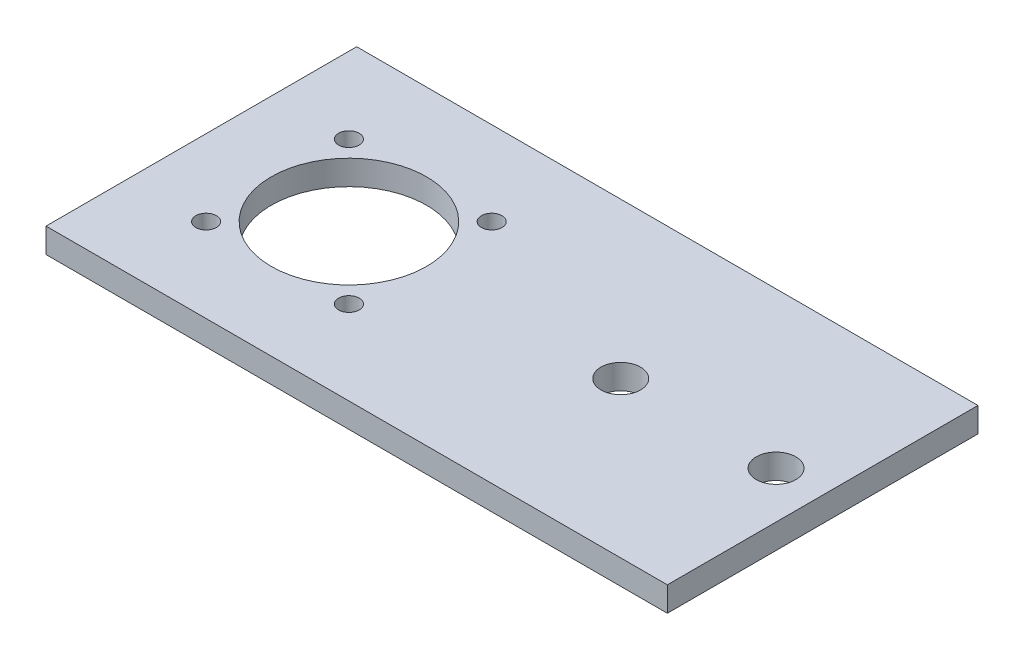
ISO-10303-21;
HEADER;
FILE_DESCRIPTION(('STEP AP214'),'2;1');
FILE_NAME('part.step','',(''),(''),'','','');
FILE_SCHEMA(('AUTOMOTIVE_DESIGN { 1 0 10303 214 1 1 1 1 }'));
ENDSEC;
DATA;
#1=APPLICATION_CONTEXT('core data for automotive mechanical design processes');
#2=APPLICATION_PROTOCOL_DEFINITION('international standard','automotive_design',2000,#1);
#3=PRODUCT_CONTEXT('',#1,'mechanical');
#4=PRODUCT('Part','Part','',(#3));
#5=PRODUCT_RELATED_PRODUCT_CATEGORY('part','',(#4));
#6=PRODUCT_DEFINITION_FORMATION('','',#4);
#7=PRODUCT_DEFINITION_CONTEXT('part definition',#1,'design');
#8=PRODUCT_DEFINITION('design','',#6,#7);
#9=PRODUCT_DEFINITION_SHAPE('','',#8);
#10=(LENGTH_UNIT() NAMED_UNIT(*) SI_UNIT(.MILLI.,.METRE.));
#11=(NAMED_UNIT(*) PLANE_ANGLE_UNIT() SI_UNIT($,.RADIAN.));
#12=(NAMED_UNIT(*) SI_UNIT($,.STERADIAN.) SOLID_ANGLE_UNIT());
#13=UNCERTAINTY_MEASURE_WITH_UNIT(LENGTH_MEASURE(1.E-05),#10,'distance_accuracy_value','');
#14=(GEOMETRIC_REPRESENTATION_CONTEXT(3) GLOBAL_UNCERTAINTY_ASSIGNED_CONTEXT((#13)) GLOBAL_UNIT_ASSIGNED_CONTEXT((#10,
#11,#12)) REPRESENTATION_CONTEXT('',''));
#15=CARTESIAN_POINT('',(0.,0.,0.));
#16=DIRECTION('',(0.,0.,1.));
#17=DIRECTION('',(1.,0.,0.));
#18=AXIS2_PLACEMENT_3D('',#15,#16,#17);
#19=CARTESIAN_POINT('',(0.,3.175,0.));
#20=DIRECTION('',(0.,-1.,0.));
#21=DIRECTION('',(0.,0.,-1.));
#22=AXIS2_PLACEMENT_3D('',#19,#20,#21);
#23=PLANE('',#22);
#24=DIRECTION('',(0.,0.,1.));
#25=VECTOR('',#24,1.);
#26=CARTESIAN_POINT('',(0.,3.175,0.));
#27=LINE('',#26,#25);
#28=CARTESIAN_POINT('',(0.,3.175,-40.));
#29=VERTEX_POINT('',#28);
#30=CARTESIAN_POINT('',(0.,3.175,0.));
#31=VERTEX_POINT('',#30);
#32=EDGE_CURVE('E99',#29,#31,#27,.T.);
#33=ORIENTED_EDGE('',*,*,#32,.T.);
#34=DIRECTION('',(1.,0.,0.));
#35=VECTOR('',#34,1.);
#36=CARTESIAN_POINT('',(0.,3.175,0.));
#37=LINE('',#36,#35);
#38=CARTESIAN_POINT('',(80.,3.175,0.));
#39=VERTEX_POINT('',#38);
#40=EDGE_CURVE('E94',#31,#39,#37,.T.);
#41=ORIENTED_EDGE('',*,*,#40,.T.);
#42=DIRECTION('',(0.,0.,-1.));
#43=VECTOR('',#42,1.);
#44=CARTESIAN_POINT('',(80.,3.175,0.));
#45=LINE('',#44,#43);
#46=CARTESIAN_POINT('',(80.,3.175,-40.));
#47=VERTEX_POINT('',#46);
#48=EDGE_CURVE('E97',#39,#47,#45,.T.);
#49=ORIENTED_EDGE('',*,*,#48,.T.);
#50=DIRECTION('',(-1.,0.,0.));
#51=VECTOR('',#50,1.);
#52=CARTESIAN_POINT('',(0.,3.175,-40.));
#53=LINE('',#52,#51);
#54=EDGE_CURVE('E64',#47,#29,#53,.T.);
#55=ORIENTED_EDGE('',*,*,#54,.T.);
#56=EDGE_LOOP('',(#33,#41,#49,#55));
#57=FACE_BOUND('',#56,.T.);
#58=CARTESIAN_POINT('',(54.,3.175,-20.));
#59=DIRECTION('',(0.,1.,0.));
#60=DIRECTION('',(0.,0.,1.));
#61=AXIS2_PLACEMENT_3D('',#58,#59,#60);
#62=CIRCLE('',#61,2.55);
#63=CARTESIAN_POINT('',(54.,3.175,-17.45));
#64=VERTEX_POINT('',#63);
#65=EDGE_CURVE('E114',#64,#64,#62,.T.);
#66=ORIENTED_EDGE('',*,*,#65,.F.);
#67=EDGE_LOOP('',(#66));
#68=FACE_BOUND('',#67,.T.);
#69=CARTESIAN_POINT('',(74.,3.175,-20.));
#70=DIRECTION('',(0.,1.,0.));
#71=DIRECTION('',(0.,0.,1.));
#72=AXIS2_PLACEMENT_3D('',#69,#70,#71);
#73=CIRCLE('',#72,2.54999999999999);
#74=CARTESIAN_POINT('',(74.,3.175,-17.45));
#75=VERTEX_POINT('',#74);
#76=EDGE_CURVE('E129',#75,#75,#73,.T.);
#77=ORIENTED_EDGE('',*,*,#76,.F.);
#78=EDGE_LOOP('',(#77));
#79=FACE_BOUND('',#78,.T.);
#80=CARTESIAN_POINT('',(19.,3.175,-20.));
#81=DIRECTION('',(0.,1.,0.));
#82=DIRECTION('',(0.,0.,1.));
#83=AXIS2_PLACEMENT_3D('',#80,#81,#82);
#84=CIRCLE('',#83,10.);
#85=CARTESIAN_POINT('',(19.,3.175,-10.));
#86=VERTEX_POINT('',#85);
#87=EDGE_CURVE('E135',#86,#86,#84,.T.);
#88=ORIENTED_EDGE('',*,*,#87,.F.);
#89=EDGE_LOOP('',(#88));
#90=FACE_BOUND('',#89,.T.);
#91=CARTESIAN_POINT('',(28.1923881554252,3.175,-10.8076118445749));
#92=DIRECTION('',(0.,1.,0.));
#93=DIRECTION('',(0.,0.,1.));
#94=AXIS2_PLACEMENT_3D('',#91,#92,#93);
#95=CIRCLE('',#94,1.325);
#96=CARTESIAN_POINT('',(28.1923881554252,3.175,-9.48261184457495));
#97=VERTEX_POINT('',#96);
#98=EDGE_CURVE('E141',#97,#97,#95,.T.);
#99=ORIENTED_EDGE('',*,*,#98,.F.);
#100=EDGE_LOOP('',(#99));
#101=FACE_BOUND('',#100,.T.);
#102=CARTESIAN_POINT('',(9.80761184457494,3.175,-10.8076118445748));
#103=DIRECTION('',(0.,1.,0.));
#104=DIRECTION('',(0.,0.,1.));
#105=AXIS2_PLACEMENT_3D('',#102,#103,#104);
#106=CIRCLE('',#105,1.325);
#107=CARTESIAN_POINT('',(9.80761184457494,3.175,-9.48261184457483));
#108=VERTEX_POINT('',#107);
#109=EDGE_CURVE('E147',#108,#108,#106,.T.);
#110=ORIENTED_EDGE('',*,*,#109,.F.);
#111=EDGE_LOOP('',(#110));
#112=FACE_BOUND('',#111,.T.);
#113=CARTESIAN_POINT('',(9.80761184457482,3.175,-29.1923881554251));
#114=DIRECTION('',(0.,1.,0.));
#115=DIRECTION('',(0.,0.,1.));
#116=AXIS2_PLACEMENT_3D('',#113,#114,#115);
#117=CIRCLE('',#116,1.325);
#118=CARTESIAN_POINT('',(9.80761184457482,3.175,-27.8673881554251));
#119=VERTEX_POINT('',#118);
#120=EDGE_CURVE('E153',#119,#119,#117,.T.);
#121=ORIENTED_EDGE('',*,*,#120,.F.);
#122=EDGE_LOOP('',(#121));
#123=FACE_BOUND('',#122,.T.);
#124=CARTESIAN_POINT('',(28.1923881554251,3.175,-29.1923881554252));
#125=DIRECTION('',(0.,1.,0.));
#126=DIRECTION('',(0.,0.,1.));
#127=AXIS2_PLACEMENT_3D('',#124,#125,#126);
#128=CIRCLE('',#127,1.325);
#129=CARTESIAN_POINT('',(28.1923881554251,3.175,-27.8673881554252));
#130=VERTEX_POINT('',#129);
#131=EDGE_CURVE('E159',#130,#130,#128,.T.);
#132=ORIENTED_EDGE('',*,*,#131,.F.);
#133=EDGE_LOOP('',(#132));
#134=FACE_BOUND('',#133,.T.);
#135=ADVANCED_FACE('F47',(#57,#68,#79,#90,#101,#112,#123,#134),#23,.F.);
#136=CARTESIAN_POINT('',(0.,0.,0.));
#137=DIRECTION('',(0.,-1.,0.));
#138=DIRECTION('',(0.,0.,-1.));
#139=AXIS2_PLACEMENT_3D('',#136,#137,#138);
#140=PLANE('',#139);
#141=CARTESIAN_POINT('',(9.80761184457482,0.,-29.1923881554251));
#142=DIRECTION('',(0.,1.,0.));
#143=DIRECTION('',(0.,0.,1.));
#144=AXIS2_PLACEMENT_3D('',#141,#142,#143);
#145=CIRCLE('',#144,1.325);
#146=CARTESIAN_POINT('',(9.80761184457482,0.,-27.8673881554251));
#147=VERTEX_POINT('',#146);
#148=EDGE_CURVE('E156',#147,#147,#145,.T.);
#149=ORIENTED_EDGE('',*,*,#148,.T.);
#150=EDGE_LOOP('',(#149));
#151=FACE_BOUND('',#150,.T.);
#152=CARTESIAN_POINT('',(28.1923881554252,0.,-10.8076118445749));
#153=DIRECTION('',(0.,1.,0.));
#154=DIRECTION('',(0.,0.,1.));
#155=AXIS2_PLACEMENT_3D('',#152,#153,#154);
#156=CIRCLE('',#155,1.325);
#157=CARTESIAN_POINT('',(28.1923881554252,0.,-9.48261184457495));
#158=VERTEX_POINT('',#157);
#159=EDGE_CURVE('E144',#158,#158,#156,.T.);
#160=ORIENTED_EDGE('',*,*,#159,.T.);
#161=EDGE_LOOP('',(#160));
#162=FACE_BOUND('',#161,.T.);
#163=CARTESIAN_POINT('',(74.,0.,-20.));
#164=DIRECTION('',(0.,1.,0.));
#165=DIRECTION('',(0.,0.,1.));
#166=AXIS2_PLACEMENT_3D('',#163,#164,#165);
#167=CIRCLE('',#166,2.54999999999999);
#168=CARTESIAN_POINT('',(74.,0.,-17.45));
#169=VERTEX_POINT('',#168);
#170=EDGE_CURVE('E132',#169,#169,#167,.T.);
#171=ORIENTED_EDGE('',*,*,#170,.T.);
#172=EDGE_LOOP('',(#171));
#173=FACE_BOUND('',#172,.T.);
#174=DIRECTION('',(0.,0.,1.));
#175=VECTOR('',#174,1.);
#176=CARTESIAN_POINT('',(0.,0.,0.));
#177=LINE('',#176,#175);
#178=CARTESIAN_POINT('',(0.,0.,-40.));
#179=VERTEX_POINT('',#178);
#180=CARTESIAN_POINT('',(0.,0.,0.));
#181=VERTEX_POINT('',#180);
#182=EDGE_CURVE('E111',#179,#181,#177,.T.);
#183=ORIENTED_EDGE('',*,*,#182,.F.);
#184=DIRECTION('',(-1.,0.,0.));
#185=VECTOR('',#184,1.);
#186=CARTESIAN_POINT('',(0.,0.,-40.));
#187=LINE('',#186,#185);
#188=CARTESIAN_POINT('',(80.,0.,-40.));
#189=VERTEX_POINT('',#188);
#190=EDGE_CURVE('E87',#189,#179,#187,.T.);
#191=ORIENTED_EDGE('',*,*,#190,.F.);
#192=DIRECTION('',(0.,0.,-1.));
#193=VECTOR('',#192,1.);
#194=CARTESIAN_POINT('',(80.,0.,0.));
#195=LINE('',#194,#193);
#196=CARTESIAN_POINT('',(80.,0.,0.));
#197=VERTEX_POINT('',#196);
#198=EDGE_CURVE('E81',#197,#189,#195,.T.);
#199=ORIENTED_EDGE('',*,*,#198,.F.);
#200=DIRECTION('',(1.,0.,0.));
#201=VECTOR('',#200,1.);
#202=CARTESIAN_POINT('',(0.,0.,0.));
#203=LINE('',#202,#201);
#204=EDGE_CURVE('E103',#181,#197,#203,.T.);
#205=ORIENTED_EDGE('',*,*,#204,.F.);
#206=EDGE_LOOP('',(#183,#191,#199,#205));
#207=FACE_BOUND('',#206,.T.);
#208=CARTESIAN_POINT('',(54.,0.,-20.));
#209=DIRECTION('',(0.,1.,0.));
#210=DIRECTION('',(0.,0.,1.));
#211=AXIS2_PLACEMENT_3D('',#208,#209,#210);
#212=CIRCLE('',#211,2.55);
#213=CARTESIAN_POINT('',(54.,0.,-17.45));
#214=VERTEX_POINT('',#213);
#215=EDGE_CURVE('E126',#214,#214,#212,.T.);
#216=ORIENTED_EDGE('',*,*,#215,.T.);
#217=EDGE_LOOP('',(#216));
#218=FACE_BOUND('',#217,.T.);
#219=CARTESIAN_POINT('',(19.,0.,-20.));
#220=DIRECTION('',(0.,1.,0.));
#221=DIRECTION('',(0.,0.,1.));
#222=AXIS2_PLACEMENT_3D('',#219,#220,#221);
#223=CIRCLE('',#222,10.);
#224=CARTESIAN_POINT('',(19.,0.,-10.));
#225=VERTEX_POINT('',#224);
#226=EDGE_CURVE('E138',#225,#225,#223,.T.);
#227=ORIENTED_EDGE('',*,*,#226,.T.);
#228=EDGE_LOOP('',(#227));
#229=FACE_BOUND('',#228,.T.);
#230=CARTESIAN_POINT('',(9.80761184457494,0.,-10.8076118445748));
#231=DIRECTION('',(0.,1.,0.));
#232=DIRECTION('',(0.,0.,1.));
#233=AXIS2_PLACEMENT_3D('',#230,#231,#232);
#234=CIRCLE('',#233,1.325);
#235=CARTESIAN_POINT('',(9.80761184457494,0.,-9.48261184457483));
#236=VERTEX_POINT('',#235);
#237=EDGE_CURVE('E150',#236,#236,#234,.T.);
#238=ORIENTED_EDGE('',*,*,#237,.T.);
#239=EDGE_LOOP('',(#238));
#240=FACE_BOUND('',#239,.T.);
#241=CARTESIAN_POINT('',(28.1923881554251,0.,-29.1923881554252));
#242=DIRECTION('',(0.,1.,0.));
#243=DIRECTION('',(0.,0.,1.));
#244=AXIS2_PLACEMENT_3D('',#241,#242,#243);
#245=CIRCLE('',#244,1.325);
#246=CARTESIAN_POINT('',(28.1923881554251,0.,-27.8673881554252));
#247=VERTEX_POINT('',#246);
#248=EDGE_CURVE('E162',#247,#247,#245,.T.);
#249=ORIENTED_EDGE('',*,*,#248,.T.);
#250=EDGE_LOOP('',(#249));
#251=FACE_BOUND('',#250,.T.);
#252=ADVANCED_FACE('F122',(#151,#162,#173,#207,#218,#229,#240,#251),#140,.T.);
#253=CARTESIAN_POINT('',(0.,3.175,0.));
#254=DIRECTION('',(1.,0.,0.));
#255=DIRECTION('',(0.,0.,-1.));
#256=AXIS2_PLACEMENT_3D('',#253,#254,#255);
#257=PLANE('',#256);
#258=ORIENTED_EDGE('',*,*,#182,.T.);
#259=DIRECTION('',(0.,-1.,0.));
#260=VECTOR('',#259,1.);
#261=CARTESIAN_POINT('',(0.,3.175,0.));
#262=LINE('',#261,#260);
#263=EDGE_CURVE('E13',#31,#181,#262,.T.);
#264=ORIENTED_EDGE('',*,*,#263,.F.);
#265=ORIENTED_EDGE('',*,*,#32,.F.);
#266=DIRECTION('',(0.,-1.,0.));
#267=VECTOR('',#266,1.);
#268=CARTESIAN_POINT('',(0.,3.175,-40.));
#269=LINE('',#268,#267);
#270=EDGE_CURVE('E107',#29,#179,#269,.T.);
#271=ORIENTED_EDGE('',*,*,#270,.T.);
#272=EDGE_LOOP('',(#258,#264,#265,#271));
#273=FACE_BOUND('',#272,.T.);
#274=ADVANCED_FACE('F49',(#273),#257,.F.);
#275=CARTESIAN_POINT('',(0.,3.175,0.));
#276=DIRECTION('',(0.,0.,-1.));
#277=DIRECTION('',(-1.,0.,0.));
#278=AXIS2_PLACEMENT_3D('',#275,#276,#277);
#279=PLANE('',#278);
#280=ORIENTED_EDGE('',*,*,#204,.T.);
#281=DIRECTION('',(0.,-1.,0.));
#282=VECTOR('',#281,1.);
#283=CARTESIAN_POINT('',(80.,3.175,0.));
#284=LINE('',#283,#282);
#285=EDGE_CURVE('E56',#39,#197,#284,.T.);
#286=ORIENTED_EDGE('',*,*,#285,.F.);
#287=ORIENTED_EDGE('',*,*,#40,.F.);
#288=ORIENTED_EDGE('',*,*,#263,.T.);
#289=EDGE_LOOP('',(#280,#286,#287,#288));
#290=FACE_BOUND('',#289,.T.);
#291=ADVANCED_FACE('F102',(#290),#279,.F.);
#292=CARTESIAN_POINT('',(80.,3.175,0.));
#293=DIRECTION('',(-1.,0.,0.));
#294=DIRECTION('',(0.,0.,1.));
#295=AXIS2_PLACEMENT_3D('',#292,#293,#294);
#296=PLANE('',#295);
#297=ORIENTED_EDGE('',*,*,#198,.T.);
#298=DIRECTION('',(0.,-1.,0.));
#299=VECTOR('',#298,1.);
#300=CARTESIAN_POINT('',(80.,3.175,-40.));
#301=LINE('',#300,#299);
#302=EDGE_CURVE('E104',#47,#189,#301,.T.);
#303=ORIENTED_EDGE('',*,*,#302,.F.);
#304=ORIENTED_EDGE('',*,*,#48,.F.);
#305=ORIENTED_EDGE('',*,*,#285,.T.);
#306=EDGE_LOOP('',(#297,#303,#304,#305));
#307=FACE_BOUND('',#306,.T.);
#308=ADVANCED_FACE('F105',(#307),#296,.F.);
#309=CARTESIAN_POINT('',(0.,3.175,-40.));
#310=DIRECTION('',(0.,0.,1.));
#311=DIRECTION('',(1.,0.,0.));
#312=AXIS2_PLACEMENT_3D('',#309,#310,#311);
#313=PLANE('',#312);
#314=ORIENTED_EDGE('',*,*,#190,.T.);
#315=ORIENTED_EDGE('',*,*,#270,.F.);
#316=ORIENTED_EDGE('',*,*,#54,.F.);
#317=ORIENTED_EDGE('',*,*,#302,.T.);
#318=EDGE_LOOP('',(#314,#315,#316,#317));
#319=FACE_BOUND('',#318,.T.);
#320=ADVANCED_FACE('F119',(#319),#313,.F.);
#321=CARTESIAN_POINT('',(54.,3.175,-20.));
#322=DIRECTION('',(0.,-1.,0.));
#323=DIRECTION('',(0.,0.,-1.));
#324=AXIS2_PLACEMENT_3D('',#321,#322,#323);
#325=CYLINDRICAL_SURFACE('',#324,2.55);
#326=ORIENTED_EDGE('',*,*,#65,.T.);
#327=EDGE_LOOP('',(#326));
#328=FACE_BOUND('',#327,.T.);
#329=ORIENTED_EDGE('',*,*,#215,.F.);
#330=EDGE_LOOP('',(#329));
#331=FACE_BOUND('',#330,.T.);
#332=ADVANCED_FACE('F179',(#328,#331),#325,.F.);
#333=CARTESIAN_POINT('',(74.,3.175,-20.));
#334=DIRECTION('',(0.,-1.,0.));
#335=DIRECTION('',(0.,0.,-1.));
#336=AXIS2_PLACEMENT_3D('',#333,#334,#335);
#337=CYLINDRICAL_SURFACE('',#336,2.54999999999999);
#338=ORIENTED_EDGE('',*,*,#76,.T.);
#339=EDGE_LOOP('',(#338));
#340=FACE_BOUND('',#339,.T.);
#341=ORIENTED_EDGE('',*,*,#170,.F.);
#342=EDGE_LOOP('',(#341));
#343=FACE_BOUND('',#342,.T.);
#344=ADVANCED_FACE('F225',(#340,#343),#337,.F.);
#345=CARTESIAN_POINT('',(19.,3.175,-20.));
#346=DIRECTION('',(0.,-1.,0.));
#347=DIRECTION('',(0.,0.,-1.));
#348=AXIS2_PLACEMENT_3D('',#345,#346,#347);
#349=CYLINDRICAL_SURFACE('',#348,10.);
#350=ORIENTED_EDGE('',*,*,#87,.T.);
#351=EDGE_LOOP('',(#350));
#352=FACE_BOUND('',#351,.T.);
#353=ORIENTED_EDGE('',*,*,#226,.F.);
#354=EDGE_LOOP('',(#353));
#355=FACE_BOUND('',#354,.T.);
#356=ADVANCED_FACE('F233',(#352,#355),#349,.F.);
#357=CARTESIAN_POINT('',(28.1923881554252,3.175,-10.8076118445749));
#358=DIRECTION('',(0.,-1.,0.));
#359=DIRECTION('',(0.,0.,-1.));
#360=AXIS2_PLACEMENT_3D('',#357,#358,#359);
#361=CYLINDRICAL_SURFACE('',#360,1.325);
#362=ORIENTED_EDGE('',*,*,#98,.T.);
#363=EDGE_LOOP('',(#362));
#364=FACE_BOUND('',#363,.T.);
#365=ORIENTED_EDGE('',*,*,#159,.F.);
#366=EDGE_LOOP('',(#365));
#367=FACE_BOUND('',#366,.T.);
#368=ADVANCED_FACE('F241',(#364,#367),#361,.F.);
#369=CARTESIAN_POINT('',(9.80761184457494,3.175,-10.8076118445748));
#370=DIRECTION('',(0.,-1.,0.));
#371=DIRECTION('',(0.,0.,-1.));
#372=AXIS2_PLACEMENT_3D('',#369,#370,#371);
#373=CYLINDRICAL_SURFACE('',#372,1.325);
#374=ORIENTED_EDGE('',*,*,#109,.T.);
#375=EDGE_LOOP('',(#374));
#376=FACE_BOUND('',#375,.T.);
#377=ORIENTED_EDGE('',*,*,#237,.F.);
#378=EDGE_LOOP('',(#377));
#379=FACE_BOUND('',#378,.T.);
#380=ADVANCED_FACE('F250',(#376,#379),#373,.F.);
#381=CARTESIAN_POINT('',(9.80761184457482,3.175,-29.1923881554251));
#382=DIRECTION('',(0.,-1.,0.));
#383=DIRECTION('',(0.,0.,-1.));
#384=AXIS2_PLACEMENT_3D('',#381,#382,#383);
#385=CYLINDRICAL_SURFACE('',#384,1.325);
#386=ORIENTED_EDGE('',*,*,#120,.T.);
#387=EDGE_LOOP('',(#386));
#388=FACE_BOUND('',#387,.T.);
#389=ORIENTED_EDGE('',*,*,#148,.F.);
#390=EDGE_LOOP('',(#389));
#391=FACE_BOUND('',#390,.T.);
#392=ADVANCED_FACE('F259',(#388,#391),#385,.F.);
#393=CARTESIAN_POINT('',(28.1923881554251,3.175,-29.1923881554252));
#394=DIRECTION('',(0.,-1.,0.));
#395=DIRECTION('',(0.,0.,-1.));
#396=AXIS2_PLACEMENT_3D('',#393,#394,#395);
#397=CYLINDRICAL_SURFACE('',#396,1.325);
#398=ORIENTED_EDGE('',*,*,#131,.T.);
#399=EDGE_LOOP('',(#398));
#400=FACE_BOUND('',#399,.T.);
#401=ORIENTED_EDGE('',*,*,#248,.F.);
#402=EDGE_LOOP('',(#401));
#403=FACE_BOUND('',#402,.T.);
#404=ADVANCED_FACE('F168',(#400,#403),#397,.F.);
#405=CLOSED_SHELL('',(#135,#252,#274,#291,#308,#320,#332,#344,#356,#368,#380,#392,#404));
#406=MANIFOLD_SOLID_BREP('B2',#405);
#407=ADVANCED_BREP_SHAPE_REPRESENTATION('',(#18,#406),#14);
#408=SHAPE_DEFINITION_REPRESENTATION(#9,#407);
ENDSEC;
END-ISO-10303-21;
